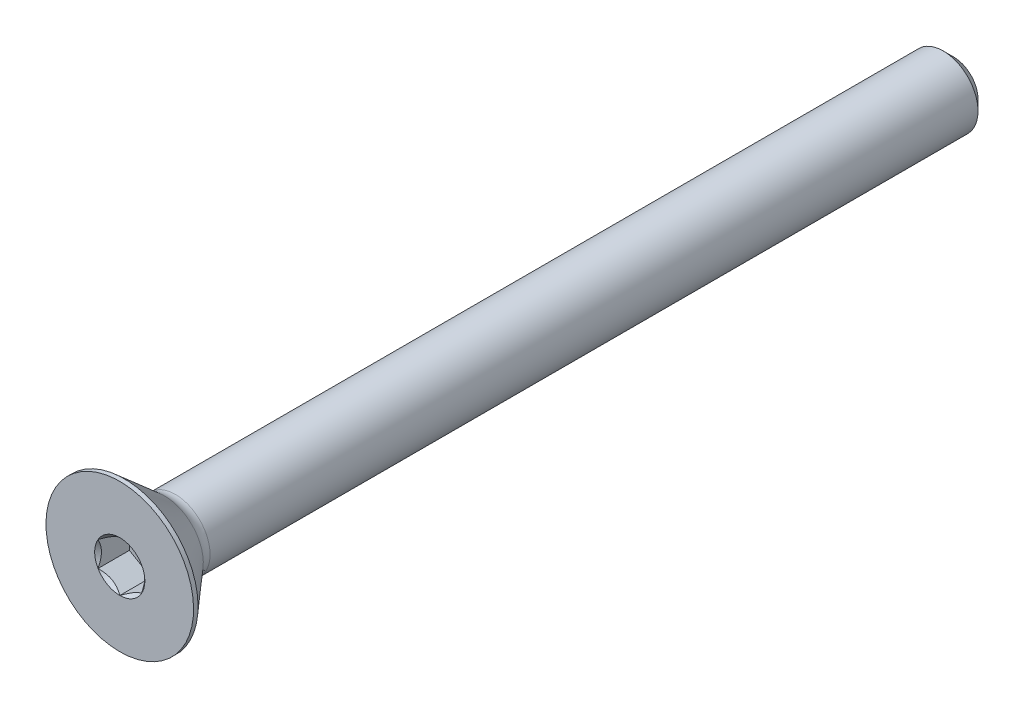
ISO-10303-21;
HEADER;
FILE_DESCRIPTION(('STEP AP214'),'2;1');
FILE_NAME('part.step','',(''),(''),'','','');
FILE_SCHEMA(('AUTOMOTIVE_DESIGN { 1 0 10303 214 1 1 1 1 }'));
ENDSEC;
DATA;
#1=APPLICATION_CONTEXT('core data for automotive mechanical design processes');
#2=APPLICATION_PROTOCOL_DEFINITION('international standard','automotive_design',2000,#1);
#3=PRODUCT_CONTEXT('',#1,'mechanical');
#4=PRODUCT('Part','Part','',(#3));
#5=PRODUCT_RELATED_PRODUCT_CATEGORY('part','',(#4));
#6=PRODUCT_DEFINITION_FORMATION('','',#4);
#7=PRODUCT_DEFINITION_CONTEXT('part definition',#1,'design');
#8=PRODUCT_DEFINITION('design','',#6,#7);
#9=PRODUCT_DEFINITION_SHAPE('','',#8);
#10=(LENGTH_UNIT() NAMED_UNIT(*) SI_UNIT(.MILLI.,.METRE.));
#11=(NAMED_UNIT(*) PLANE_ANGLE_UNIT() SI_UNIT($,.RADIAN.));
#12=(NAMED_UNIT(*) SI_UNIT($,.STERADIAN.) SOLID_ANGLE_UNIT());
#13=UNCERTAINTY_MEASURE_WITH_UNIT(LENGTH_MEASURE(1.E-05),#10,'distance_accuracy_value','');
#14=(GEOMETRIC_REPRESENTATION_CONTEXT(3) GLOBAL_UNCERTAINTY_ASSIGNED_CONTEXT((#13)) GLOBAL_UNIT_ASSIGNED_CONTEXT((#10,
#11,#12)) REPRESENTATION_CONTEXT('',''));
#15=CARTESIAN_POINT('',(0.,0.,0.));
#16=DIRECTION('',(0.,0.,1.));
#17=DIRECTION('',(1.,0.,0.));
#18=AXIS2_PLACEMENT_3D('',#15,#16,#17);
#19=CARTESIAN_POINT('',(0.,0.,-76.2));
#20=DIRECTION('',(0.,0.,-1.));
#21=DIRECTION('',(0.,1.,0.));
#22=AXIS2_PLACEMENT_3D('',#19,#20,#21);
#23=CYLINDRICAL_SURFACE('',#22,3.175);
#24=CARTESIAN_POINT('',(0.,0.,-75.2475));
#25=DIRECTION('',(0.,0.,-1.));
#26=DIRECTION('',(0.,1.,0.));
#27=AXIS2_PLACEMENT_3D('',#24,#25,#26);
#28=CIRCLE('',#27,3.175);
#29=CARTESIAN_POINT('',(0.,3.175,-75.2475));
#30=VERTEX_POINT('',#29);
#31=EDGE_CURVE('E50',#30,#30,#28,.F.);
#32=ORIENTED_EDGE('',*,*,#31,.T.);
#33=EDGE_LOOP('',(#32));
#34=FACE_BOUND('',#33,.T.);
#35=CARTESIAN_POINT('',(0.,0.,-5.07720440387604));
#36=DIRECTION('',(0.,0.,1.));
#37=DIRECTION('',(0.,-1.,0.));
#38=AXIS2_PLACEMENT_3D('',#35,#36,#37);
#39=CIRCLE('',#38,3.175);
#40=CARTESIAN_POINT('',(0.,-3.17500000000001,-5.07720440387604));
#41=VERTEX_POINT('',#40);
#42=EDGE_CURVE('E177',#41,#41,#39,.T.);
#43=ORIENTED_EDGE('',*,*,#42,.F.);
#44=EDGE_LOOP('',(#43));
#45=FACE_BOUND('',#44,.T.);
#46=ADVANCED_FACE('F36',(#34,#45),#23,.T.);
#47=CARTESIAN_POINT('',(0.,-3.17499999999999,-76.2));
#48=DIRECTION('',(0.,0.,-1.));
#49=DIRECTION('',(0.,1.,0.));
#50=AXIS2_PLACEMENT_3D('',#47,#48,#49);
#51=PLANE('',#50);
#52=CARTESIAN_POINT('',(0.,0.,-76.2));
#53=DIRECTION('',(0.,0.,-1.));
#54=DIRECTION('',(0.,1.,0.));
#55=AXIS2_PLACEMENT_3D('',#52,#53,#54);
#56=CIRCLE('',#55,2.2225);
#57=CARTESIAN_POINT('',(0.,2.22250000000001,-76.2));
#58=VERTEX_POINT('',#57);
#59=EDGE_CURVE('E180',#58,#58,#56,.T.);
#60=ORIENTED_EDGE('',*,*,#59,.T.);
#61=EDGE_LOOP('',(#60));
#62=FACE_BOUND('',#61,.T.);
#63=ADVANCED_FACE('F190',(#62),#51,.T.);
#64=CARTESIAN_POINT('',(0.,0.,-76.2));
#65=DIRECTION('',(0.,0.,1.));
#66=DIRECTION('',(0.,-1.,0.));
#67=AXIS2_PLACEMENT_3D('',#64,#65,#66);
#68=CONICAL_SURFACE('',#67,2.2225,0.785398163397442);
#69=ORIENTED_EDGE('',*,*,#31,.F.);
#70=EDGE_LOOP('',(#69));
#71=FACE_BOUND('',#70,.T.);
#72=ORIENTED_EDGE('',*,*,#59,.F.);
#73=EDGE_LOOP('',(#72));
#74=FACE_BOUND('',#73,.T.);
#75=ADVANCED_FACE('F38',(#71,#74),#68,.T.);
#76=CARTESIAN_POINT('',(0.,0.,-5.07720440387604));
#77=DIRECTION('',(0.,0.,1.));
#78=DIRECTION('',(0.,-1.,0.));
#79=AXIS2_PLACEMENT_3D('',#76,#77,#78);
#80=TOROIDAL_SURFACE('',#79,4.68066391166966,1.50566391166966);
#81=CARTESIAN_POINT('',(0.,0.,-4.0894));
#82=DIRECTION('',(0.,0.,1.));
#83=DIRECTION('',(0.,-1.,0.));
#84=AXIS2_PLACEMENT_3D('',#81,#82,#83);
#85=CIRCLE('',#84,3.54432493293688);
#86=CARTESIAN_POINT('',(0.,-3.54432493293688,-4.0894));
#87=VERTEX_POINT('',#86);
#88=EDGE_CURVE('E174',#87,#87,#85,.T.);
#89=ORIENTED_EDGE('',*,*,#88,.F.);
#90=EDGE_LOOP('',(#89));
#91=FACE_BOUND('',#90,.T.);
#92=ORIENTED_EDGE('',*,*,#42,.T.);
#93=EDGE_LOOP('',(#92));
#94=FACE_BOUND('',#93,.T.);
#95=ADVANCED_FACE('F189',(#91,#94),#80,.F.);
#96=CARTESIAN_POINT('',(0.,0.,-4.0894));
#97=DIRECTION('',(0.,0.,1.));
#98=DIRECTION('',(0.,-1.,0.));
#99=AXIS2_PLACEMENT_3D('',#96,#97,#98);
#100=CONICAL_SURFACE('',#99,3.54432493293688,0.715584993317676);
#101=CARTESIAN_POINT('',(0.,0.,-0.408939999999995));
#102=DIRECTION('',(0.,0.,1.));
#103=DIRECTION('',(0.,-1.,0.));
#104=AXIS2_PLACEMENT_3D('',#101,#102,#103);
#105=CIRCLE('',#104,6.7437);
#106=CARTESIAN_POINT('',(0.,-6.7437,-0.40893999999999));
#107=VERTEX_POINT('',#106);
#108=EDGE_CURVE('E171',#107,#107,#105,.T.);
#109=ORIENTED_EDGE('',*,*,#108,.F.);
#110=EDGE_LOOP('',(#109));
#111=FACE_BOUND('',#110,.T.);
#112=ORIENTED_EDGE('',*,*,#88,.T.);
#113=EDGE_LOOP('',(#112));
#114=FACE_BOUND('',#113,.T.);
#115=ADVANCED_FACE('F204',(#111,#114),#100,.T.);
#116=CARTESIAN_POINT('',(0.,0.,0.));
#117=DIRECTION('',(0.,0.,1.));
#118=DIRECTION('',(0.,-1.,0.));
#119=AXIS2_PLACEMENT_3D('',#116,#117,#118);
#120=CYLINDRICAL_SURFACE('',#119,6.7437);
#121=CARTESIAN_POINT('',(0.,0.,0.));
#122=DIRECTION('',(0.,0.,1.));
#123=DIRECTION('',(0.,-1.,0.));
#124=AXIS2_PLACEMENT_3D('',#121,#122,#123);
#125=CIRCLE('',#124,6.7437);
#126=CARTESIAN_POINT('',(0.,-6.7437,0.));
#127=VERTEX_POINT('',#126);
#128=EDGE_CURVE('E168',#127,#127,#125,.T.);
#129=ORIENTED_EDGE('',*,*,#128,.F.);
#130=EDGE_LOOP('',(#129));
#131=FACE_BOUND('',#130,.T.);
#132=ORIENTED_EDGE('',*,*,#108,.T.);
#133=EDGE_LOOP('',(#132));
#134=FACE_BOUND('',#133,.T.);
#135=ADVANCED_FACE('F200',(#131,#134),#120,.T.);
#136=CARTESIAN_POINT('',(0.,-3.175,0.));
#137=DIRECTION('',(0.,0.,1.));
#138=DIRECTION('',(0.,-1.,0.));
#139=AXIS2_PLACEMENT_3D('',#136,#137,#138);
#140=PLANE('',#139);
#141=CARTESIAN_POINT('',(0.,0.,0.));
#142=DIRECTION('',(0.,0.,1.));
#143=DIRECTION('',(1.,0.,0.));
#144=AXIS2_PLACEMENT_3D('',#141,#142,#143);
#145=CIRCLE('',#144,2.29135888084633);
#146=CARTESIAN_POINT('',(0.,-2.29135888084633,0.));
#147=VERTEX_POINT('',#146);
#148=CARTESIAN_POINT('',(1.984375,-1.14567944042317,0.));
#149=VERTEX_POINT('',#148);
#150=EDGE_CURVE('E96',#147,#149,#145,.T.);
#151=ORIENTED_EDGE('',*,*,#150,.F.);
#152=CARTESIAN_POINT('',(-1.984375,-1.14567944042316,0.));
#153=VERTEX_POINT('',#152);
#154=EDGE_CURVE('E56',#153,#147,#145,.T.);
#155=ORIENTED_EDGE('',*,*,#154,.F.);
#156=CARTESIAN_POINT('',(-1.984375,1.14567944042317,0.));
#157=VERTEX_POINT('',#156);
#158=EDGE_CURVE('E138',#157,#153,#145,.T.);
#159=ORIENTED_EDGE('',*,*,#158,.F.);
#160=CARTESIAN_POINT('',(0.,2.29135888084633,0.));
#161=VERTEX_POINT('',#160);
#162=EDGE_CURVE('E63',#161,#157,#145,.T.);
#163=ORIENTED_EDGE('',*,*,#162,.F.);
#164=CARTESIAN_POINT('',(1.984375,1.14567944042317,0.));
#165=VERTEX_POINT('',#164);
#166=EDGE_CURVE('E132',#165,#161,#145,.T.);
#167=ORIENTED_EDGE('',*,*,#166,.F.);
#168=EDGE_CURVE('E104',#149,#165,#145,.T.);
#169=ORIENTED_EDGE('',*,*,#168,.F.);
#170=EDGE_LOOP('',(#151,#155,#159,#163,#167,#169));
#171=FACE_BOUND('',#170,.T.);
#172=ORIENTED_EDGE('',*,*,#128,.T.);
#173=EDGE_LOOP('',(#172));
#174=FACE_BOUND('',#173,.T.);
#175=ADVANCED_FACE('F130',(#171,#174),#140,.T.);
#176=CARTESIAN_POINT('',(0.,0.,0.));
#177=DIRECTION('',(0.,0.,1.));
#178=DIRECTION('',(1.,0.,0.));
#179=AXIS2_PLACEMENT_3D('',#176,#177,#178);
#180=CONICAL_SURFACE('',#179,2.29135888084633,0.78539816339745);
#181=ORIENTED_EDGE('',*,*,#168,.T.);
#182=CARTESIAN_POINT('',(1.984375,-2.28495242157823,0.734984078816569));
#183=CARTESIAN_POINT('',(1.984375,-2.22931635455402,0.692986685550763));
#184=CARTESIAN_POINT('',(1.984375,-2.17336876548389,0.651396054076337));
#185=CARTESIAN_POINT('',(1.984375,-2.06072770258171,0.56920846147148));
#186=CARTESIAN_POINT('',(1.984375,-2.00403404503435,0.528611752405044));
#187=CARTESIAN_POINT('',(1.984375,-1.88936329173489,0.448303503174669));
#188=CARTESIAN_POINT('',(1.984375,-1.83137965519348,0.408601258813308));
#189=CARTESIAN_POINT('',(1.984375,-1.7144280213784,0.330685173401292));
#190=CARTESIAN_POINT('',(1.984375,-1.65546009407228,0.292471227194369));
#191=CARTESIAN_POINT('',(1.984375,-1.47005472306035,0.176252834013637));
#192=CARTESIAN_POINT('',(1.984375,-1.34163909427884,0.101347886872381));
#193=CARTESIAN_POINT('',(1.984375,-1.0784038470548,-0.0356697845602627));
#194=CARTESIAN_POINT('',(1.984375,-0.943607781407426,-0.0978256335176253));
#195=CARTESIAN_POINT('',(1.984375,-0.741275100444883,-0.173867421311382));
#196=CARTESIAN_POINT('',(1.984375,-0.676735408881096,-0.195691938673996));
#197=CARTESIAN_POINT('',(1.984375,-0.546098118112763,-0.234159536462206));
#198=CARTESIAN_POINT('',(1.984375,-0.480000411919957,-0.250802259934452));
#199=CARTESIAN_POINT('',(1.984375,-0.347746170028533,-0.277764619130278));
#200=CARTESIAN_POINT('',(1.984375,-0.281612071479124,-0.288192590264109));
#201=CARTESIAN_POINT('',(1.984375,-0.148636620052351,-0.302521852623405));
#202=CARTESIAN_POINT('',(1.984375,-0.0817953907393245,-0.306424265772615));
#203=CARTESIAN_POINT('',(1.984375,0.0495156750890637,-0.307412948667328));
#204=CARTESIAN_POINT('',(1.984375,0.113983775102991,-0.304740821124986));
#205=CARTESIAN_POINT('',(1.984375,0.242367515846176,-0.293260789502486));
#206=CARTESIAN_POINT('',(1.984375,0.306283102295919,-0.284452289360787));
#207=CARTESIAN_POINT('',(1.984375,0.434181040262184,-0.261030978667104));
#208=CARTESIAN_POINT('',(1.984375,0.498145026858309,-0.246319393767915));
#209=CARTESIAN_POINT('',(1.984375,0.624675616953007,-0.211873818587875));
#210=CARTESIAN_POINT('',(1.984375,0.687242336899688,-0.192140248550806));
#211=CARTESIAN_POINT('',(1.984375,0.884225483826086,-0.122587762769242));
#212=CARTESIAN_POINT('',(1.984375,1.01583674256468,-0.0648475887435049));
#213=CARTESIAN_POINT('',(1.984375,1.27288659242651,0.0635303365887961));
#214=CARTESIAN_POINT('',(1.984375,1.3983008827048,0.13421442491941));
#215=CARTESIAN_POINT('',(1.984375,1.57956687990221,0.244516663813196));
#216=CARTESIAN_POINT('',(1.984375,1.63738271299423,0.280969829475361));
#217=CARTESIAN_POINT('',(1.984375,1.75202215386201,0.355415963291702));
#218=CARTESIAN_POINT('',(1.984375,1.80884568601361,0.393409048078051));
#219=CARTESIAN_POINT('',(1.984375,1.92116923084255,0.470338808893088));
#220=CARTESIAN_POINT('',(1.984375,1.97667624512253,0.509265313038788));
#221=CARTESIAN_POINT('',(1.984375,2.08693170717166,0.588147746121384));
#222=CARTESIAN_POINT('',(1.984375,2.14168035934792,0.628103389024027));
#223=CARTESIAN_POINT('',(1.984375,2.19611149046622,0.668480611285424));
#224=B_SPLINE_CURVE_WITH_KNOTS('',3,(#182,#183,#184,#185,#186,#187,#188,#189,#190,#191,#192,
#193,#194,#195,#196,#197,#198,#199,#200,#201,#202,#203,#204,#205,#206,#207,#208,#209,#210,#211,
#212,#213,#214,#215,#216,#217,#218,#219,#220,#221,#222,#223),.UNSPECIFIED.,.F.,.F.,(4,2,2,2,2,2,
2,2,2,2,2,2,2,2,2,2,2,2,2,2,4),(0.,0.209126070008322,0.41830463735657,0.629103979977993,
0.839888401371186,1.28549951116127,1.72957750768351,1.93379389749972,2.13802435186698,
2.33858179514334,2.53910475350639,2.73236963400794,2.92565329006887,3.12231577097488,
3.31896180041345,3.74886295245172,4.18033428125362,4.3853601718029,4.59040161996383,
4.79377749165108,4.99709743524131),.UNSPECIFIED.);
#225=EDGE_CURVE('E12',#149,#165,#224,.T.);
#226=ORIENTED_EDGE('',*,*,#225,.F.);
#227=EDGE_LOOP('',(#181,#226));
#228=FACE_BOUND('',#227,.T.);
#229=ADVANCED_FACE('F108',(#228),#180,.F.);
#230=ORIENTED_EDGE('',*,*,#166,.T.);
#231=CARTESIAN_POINT('',(1.984575,1.14556397036933,0.000115478781842512));
#232=CARTESIAN_POINT('',(1.9163590048332,1.18494849354192,-0.0392371477360855));
#233=CARTESIAN_POINT('',(1.84700231489303,1.22499159714897,-0.0762786895538155));
#234=CARTESIAN_POINT('',(1.70557619954781,1.30664400291398,-0.144101141576677));
#235=CARTESIAN_POINT('',(1.63349332126322,1.34826107209555,-0.174844310908246));
#236=CARTESIAN_POINT('',(1.488141602734,1.43217992591557,-0.227508111188786));
#237=CARTESIAN_POINT('',(1.41490978751306,1.47446033414663,-0.249561124120036));
#238=CARTESIAN_POINT('',(1.26683381740529,1.55995203534886,-0.283538507056124));
#239=CARTESIAN_POINT('',(1.19199418724658,1.60316071596705,-0.295488243908271));
#240=CARTESIAN_POINT('',(1.06301458545618,1.6776271237807,-0.306269900918094));
#241=CARTESIAN_POINT('',(1.00904128422756,1.7087886237741,-0.30786610094093));
#242=CARTESIAN_POINT('',(0.901182881480199,1.77106070163465,-0.305178161134707));
#243=CARTESIAN_POINT('',(0.847297817514476,1.80217125782056,-0.300891959659541));
#244=CARTESIAN_POINT('',(0.740036461751395,1.86409863044402,-0.286683126986481));
#245=CARTESIAN_POINT('',(0.686660807239859,1.89491507894443,-0.276754189547727));
#246=CARTESIAN_POINT('',(0.580832482591103,1.95601509066828,-0.251804915725461));
#247=CARTESIAN_POINT('',(0.528379742028898,1.9862986945516,-0.236784969610511));
#248=CARTESIAN_POINT('',(0.394017661036351,2.06387267818152,-0.19219214836433));
#249=CARTESIAN_POINT('',(0.312941642841675,2.11068193911104,-0.159257004061667));
#250=CARTESIAN_POINT('',(0.193726693270161,2.17951072233758,-0.103657558797803));
#251=CARTESIAN_POINT('',(0.154440075613999,2.20219286161692,-0.0841224079481374));
#252=CARTESIAN_POINT('',(0.0765946381319475,2.24713694590237,-0.0432712618805983));
#253=CARTESIAN_POINT('',(0.0380353888983018,2.26939913882716,-0.0219563604316494));
#254=CARTESIAN_POINT('',(-0.000199999999999519,2.29147435090017,0.000115478781842769));
#255=B_SPLINE_CURVE_WITH_KNOTS('',3,(#231,#232,#233,#234,#235,#236,#237,#238,#239,#240,#241,
#242,#243,#244,#245,#246,#247,#248,#249,#250,#251,#252,#253,#254),.UNSPECIFIED.,.F.,.F.,(4,2,2,
2,2,2,2,2,2,2,2,4),(0.,0.264339630306627,0.530219665093694,0.79187641637146,1.05287424418109,
1.239639843932,1.42647091743852,1.61351120244035,1.8005371524754,2.09764209964316,
2.24579179873713,2.39385111134157),.UNSPECIFIED.);
#256=EDGE_CURVE('E134',#165,#161,#255,.T.);
#257=ORIENTED_EDGE('',*,*,#256,.F.);
#258=EDGE_LOOP('',(#230,#257));
#259=FACE_BOUND('',#258,.T.);
#260=ADVANCED_FACE('F285',(#259),#180,.F.);
#261=ORIENTED_EDGE('',*,*,#162,.T.);
#262=CARTESIAN_POINT('',(0.000200000000000698,2.29147435090017,0.000115478781843248));
#263=CARTESIAN_POINT('',(-0.0680159951668018,2.25208982772757,-0.0392371477360851));
#264=CARTESIAN_POINT('',(-0.137372685106965,2.21204672412052,-0.0762786895538152));
#265=CARTESIAN_POINT('',(-0.278798800452187,2.13039431835551,-0.144101141576677));
#266=CARTESIAN_POINT('',(-0.350881678736782,2.08877724917394,-0.174844310908247));
#267=CARTESIAN_POINT('',(-0.496233397266004,2.00485839535392,-0.227508111188787));
#268=CARTESIAN_POINT('',(-0.569465212486938,1.96257798712287,-0.249561124120036));
#269=CARTESIAN_POINT('',(-0.717541182594706,1.87708628592063,-0.283538507056124));
#270=CARTESIAN_POINT('',(-0.792380812753425,1.83387760530244,-0.295488243908272));
#271=CARTESIAN_POINT('',(-0.921360414543816,1.75941119748879,-0.306269900918094));
#272=CARTESIAN_POINT('',(-0.975333715772443,1.72824969749539,-0.30786610094093));
#273=CARTESIAN_POINT('',(-1.0831921185198,1.66597761963484,-0.305178161134707));
#274=CARTESIAN_POINT('',(-1.13707718248552,1.63486706344893,-0.30089195965954));
#275=CARTESIAN_POINT('',(-1.2443385382486,1.57293969082547,-0.286683126986481));
#276=CARTESIAN_POINT('',(-1.29771419276014,1.54212324232506,-0.276754189547727));
#277=CARTESIAN_POINT('',(-1.4035425174089,1.48102323060122,-0.251804915725462));
#278=CARTESIAN_POINT('',(-1.4559952579711,1.45073962671789,-0.236784969610512));
#279=CARTESIAN_POINT('',(-1.59035733896365,1.37316564308797,-0.19219214836433));
#280=CARTESIAN_POINT('',(-1.67143335715833,1.32635638215845,-0.159257004061667));
#281=CARTESIAN_POINT('',(-1.79064830672984,1.25752759893191,-0.103657558797803));
#282=CARTESIAN_POINT('',(-1.829934924386,1.23484545965257,-0.0841224079481369));
#283=CARTESIAN_POINT('',(-1.90778036186805,1.18990137536713,-0.0432712618805977));
#284=CARTESIAN_POINT('',(-1.9463396111017,1.16763918244233,-0.0219563604316488));
#285=CARTESIAN_POINT('',(-1.984575,1.14556397036933,0.000115478781843755));
#286=B_SPLINE_CURVE_WITH_KNOTS('',3,(#262,#263,#264,#265,#266,#267,#268,#269,#270,#271,#272,
#273,#274,#275,#276,#277,#278,#279,#280,#281,#282,#283,#284,#285),.UNSPECIFIED.,.F.,.F.,(4,2,2,
2,2,2,2,2,2,2,2,4),(0.,0.264339630306627,0.530219665093694,0.791876416371461,1.05287424418109,
1.239639843932,1.42647091743852,1.61351120244035,1.8005371524754,2.09764209964316,
2.24579179873714,2.39385111134157),.UNSPECIFIED.);
#287=EDGE_CURVE('E137',#161,#157,#286,.T.);
#288=ORIENTED_EDGE('',*,*,#287,.F.);
#289=EDGE_LOOP('',(#261,#288));
#290=FACE_BOUND('',#289,.T.);
#291=ADVANCED_FACE('F281',(#290),#180,.F.);
#292=ORIENTED_EDGE('',*,*,#158,.T.);
#293=CARTESIAN_POINT('',(-1.984375,-2.28495242157822,0.734984078816569));
#294=CARTESIAN_POINT('',(-1.984375,-2.22931635455402,0.692986685550762));
#295=CARTESIAN_POINT('',(-1.984375,-2.17336876548389,0.651396054076337));
#296=CARTESIAN_POINT('',(-1.984375,-2.06072770258171,0.56920846147148));
#297=CARTESIAN_POINT('',(-1.984375,-2.00403404503435,0.528611752405044));
#298=CARTESIAN_POINT('',(-1.984375,-1.88936329173489,0.44830350317467));
#299=CARTESIAN_POINT('',(-1.984375,-1.83137965519348,0.408601258813308));
#300=CARTESIAN_POINT('',(-1.984375,-1.7144280213784,0.330685173401293));
#301=CARTESIAN_POINT('',(-1.984375,-1.65546009407228,0.292471227194369));
#302=CARTESIAN_POINT('',(-1.984375,-1.47005472306035,0.176252834013637));
#303=CARTESIAN_POINT('',(-1.984375,-1.34163909427884,0.101347886872382));
#304=CARTESIAN_POINT('',(-1.984375,-1.0784038470548,-0.0356697845602619));
#305=CARTESIAN_POINT('',(-1.984375,-0.943607781407425,-0.0978256335176249));
#306=CARTESIAN_POINT('',(-1.984375,-0.741275100444882,-0.173867421311381));
#307=CARTESIAN_POINT('',(-1.984375,-0.676735408881095,-0.195691938673995));
#308=CARTESIAN_POINT('',(-1.984375,-0.546098118112761,-0.234159536462205));
#309=CARTESIAN_POINT('',(-1.984375,-0.480000411919955,-0.250802259934451));
#310=CARTESIAN_POINT('',(-1.984375,-0.347746170028531,-0.277764619130277));
#311=CARTESIAN_POINT('',(-1.984375,-0.281612071479122,-0.288192590264108));
#312=CARTESIAN_POINT('',(-1.984375,-0.14863662005235,-0.302521852623404));
#313=CARTESIAN_POINT('',(-1.984375,-0.0817953907393235,-0.306424265772614));
#314=CARTESIAN_POINT('',(-1.984375,0.0495156750890646,-0.307412948667327));
#315=CARTESIAN_POINT('',(-1.984375,0.113983775102992,-0.304740821124985));
#316=CARTESIAN_POINT('',(-1.984375,0.242367515846177,-0.293260789502484));
#317=CARTESIAN_POINT('',(-1.984375,0.30628310229592,-0.284452289360785));
#318=CARTESIAN_POINT('',(-1.984375,0.434181040262184,-0.261030978667103));
#319=CARTESIAN_POINT('',(-1.984375,0.49814502685831,-0.246319393767914));
#320=CARTESIAN_POINT('',(-1.984375,0.624675616953007,-0.211873818587873));
#321=CARTESIAN_POINT('',(-1.984375,0.687242336899689,-0.192140248550804));
#322=CARTESIAN_POINT('',(-1.984375,0.884225483826088,-0.12258776276924));
#323=CARTESIAN_POINT('',(-1.984375,1.01583674256468,-0.0648475887435028));
#324=CARTESIAN_POINT('',(-1.984375,1.27288659242652,0.0635303365887983));
#325=CARTESIAN_POINT('',(-1.984375,1.3983008827048,0.134214424919413));
#326=CARTESIAN_POINT('',(-1.984375,1.57956687990221,0.244516663813198));
#327=CARTESIAN_POINT('',(-1.984375,1.63738271299424,0.280969829475363));
#328=CARTESIAN_POINT('',(-1.984375,1.75202215386202,0.355415963291704));
#329=CARTESIAN_POINT('',(-1.984375,1.80884568601361,0.393409048078054));
#330=CARTESIAN_POINT('',(-1.984375,1.92116923084255,0.47033880889309));
#331=CARTESIAN_POINT('',(-1.984375,1.97667624512253,0.50926531303879));
#332=CARTESIAN_POINT('',(-1.984375,2.08693170717166,0.588147746121385));
#333=CARTESIAN_POINT('',(-1.984375,2.14168035934792,0.628103389024029));
#334=CARTESIAN_POINT('',(-1.984375,2.19611149046622,0.668480611285425));
#335=B_SPLINE_CURVE_WITH_KNOTS('',3,(#293,#294,#295,#296,#297,#298,#299,#300,#301,#302,#303,
#304,#305,#306,#307,#308,#309,#310,#311,#312,#313,#314,#315,#316,#317,#318,#319,#320,#321,#322,
#323,#324,#325,#326,#327,#328,#329,#330,#331,#332,#333,#334),.UNSPECIFIED.,.F.,.F.,(4,2,2,2,2,2,
2,2,2,2,2,2,2,2,2,2,2,2,2,2,4),(0.,0.209126070008322,0.418304637356569,0.629103979977992,
0.839888401371184,1.28549951116127,1.72957750768351,1.93379389749972,2.13802435186698,
2.33858179514334,2.53910475350639,2.73236963400794,2.92565329006887,3.12231577097488,
3.31896180041345,3.74886295245172,4.18033428125362,4.3853601718029,4.59040161996383,
4.79377749165108,4.99709743524131),.UNSPECIFIED.);
#336=EDGE_CURVE('E144',#157,#153,#335,.F.);
#337=ORIENTED_EDGE('',*,*,#336,.F.);
#338=EDGE_LOOP('',(#292,#337));
#339=FACE_BOUND('',#338,.T.);
#340=ADVANCED_FACE('F142',(#339),#180,.F.);
#341=ORIENTED_EDGE('',*,*,#154,.T.);
#342=CARTESIAN_POINT('',(-1.984575,-1.14556397036933,0.000115478781843379));
#343=CARTESIAN_POINT('',(-1.9163590048332,-1.18494849354192,-0.0392371477360854));
#344=CARTESIAN_POINT('',(-1.84700231489303,-1.22499159714897,-0.0762786895538155));
#345=CARTESIAN_POINT('',(-1.70557619954781,-1.30664400291398,-0.144101141576677));
#346=CARTESIAN_POINT('',(-1.63349332126322,-1.34826107209555,-0.174844310908246));
#347=CARTESIAN_POINT('',(-1.488141602734,-1.43217992591557,-0.227508111188786));
#348=CARTESIAN_POINT('',(-1.41490978751306,-1.47446033414663,-0.249561124120036));
#349=CARTESIAN_POINT('',(-1.26683381740529,-1.55995203534886,-0.283538507056124));
#350=CARTESIAN_POINT('',(-1.19199418724658,-1.60316071596705,-0.295488243908272));
#351=CARTESIAN_POINT('',(-1.06301458545618,-1.6776271237807,-0.306269900918094));
#352=CARTESIAN_POINT('',(-1.00904128422756,-1.7087886237741,-0.30786610094093));
#353=CARTESIAN_POINT('',(-0.901182881480199,-1.77106070163465,-0.305178161134708));
#354=CARTESIAN_POINT('',(-0.847297817514476,-1.80217125782056,-0.300891959659541));
#355=CARTESIAN_POINT('',(-0.740036461751396,-1.86409863044402,-0.286683126986481));
#356=CARTESIAN_POINT('',(-0.686660807239859,-1.89491507894443,-0.276754189547727));
#357=CARTESIAN_POINT('',(-0.580832482591103,-1.95601509066828,-0.251804915725461));
#358=CARTESIAN_POINT('',(-0.528379742028898,-1.9862986945516,-0.236784969610511));
#359=CARTESIAN_POINT('',(-0.394017661036351,-2.06387267818152,-0.192192148364329));
#360=CARTESIAN_POINT('',(-0.312941642841675,-2.11068193911104,-0.159257004061667));
#361=CARTESIAN_POINT('',(-0.19372669327016,-2.17951072233758,-0.103657558797803));
#362=CARTESIAN_POINT('',(-0.154440075613999,-2.20219286161692,-0.0841224079481374));
#363=CARTESIAN_POINT('',(-0.076594638131947,-2.24713694590237,-0.043271261880598));
#364=CARTESIAN_POINT('',(-0.0380353888983013,-2.26939913882716,-0.0219563604316491));
#365=CARTESIAN_POINT('',(0.000199999999999913,-2.29147435090017,0.000115478781843129));
#366=B_SPLINE_CURVE_WITH_KNOTS('',3,(#342,#343,#344,#345,#346,#347,#348,#349,#350,#351,#352,
#353,#354,#355,#356,#357,#358,#359,#360,#361,#362,#363,#364,#365),.UNSPECIFIED.,.F.,.F.,(4,2,2,
2,2,2,2,2,2,2,2,4),(0.,0.264339630306627,0.530219665093695,0.791876416371461,1.05287424418109,
1.239639843932,1.42647091743852,1.61351120244035,1.8005371524754,2.09764209964316,
2.24579179873714,2.39385111134157),.UNSPECIFIED.);
#367=EDGE_CURVE('E120',#153,#147,#366,.T.);
#368=ORIENTED_EDGE('',*,*,#367,.F.);
#369=EDGE_LOOP('',(#341,#368));
#370=FACE_BOUND('',#369,.T.);
#371=ADVANCED_FACE('F233',(#370),#180,.F.);
#372=ORIENTED_EDGE('',*,*,#150,.T.);
#373=CARTESIAN_POINT('',(-0.000200000000000155,-2.29147435090017,0.000115478781843248));
#374=CARTESIAN_POINT('',(0.0680159951668022,-2.25208982772757,-0.0392371477360846));
#375=CARTESIAN_POINT('',(0.137372685106966,-2.21204672412052,-0.0762786895538146));
#376=CARTESIAN_POINT('',(0.278798800452187,-2.13039431835551,-0.144101141576676));
#377=CARTESIAN_POINT('',(0.350881678736782,-2.08877724917394,-0.174844310908246));
#378=CARTESIAN_POINT('',(0.496233397266003,-2.00485839535392,-0.227508111188786));
#379=CARTESIAN_POINT('',(0.569465212486938,-1.96257798712287,-0.249561124120036));
#380=CARTESIAN_POINT('',(0.717541182594706,-1.87708628592063,-0.283538507056124));
#381=CARTESIAN_POINT('',(0.792380812753424,-1.83387760530244,-0.295488243908271));
#382=CARTESIAN_POINT('',(0.921360414543815,-1.75941119748879,-0.306269900918094));
#383=CARTESIAN_POINT('',(0.975333715772442,-1.72824969749539,-0.30786610094093));
#384=CARTESIAN_POINT('',(1.0831921185198,-1.66597761963484,-0.305178161134707));
#385=CARTESIAN_POINT('',(1.13707718248552,-1.63486706344893,-0.300891959659541));
#386=CARTESIAN_POINT('',(1.2443385382486,-1.57293969082547,-0.286683126986481));
#387=CARTESIAN_POINT('',(1.29771419276014,-1.54212324232506,-0.276754189547727));
#388=CARTESIAN_POINT('',(1.4035425174089,-1.48102323060122,-0.251804915725461));
#389=CARTESIAN_POINT('',(1.4559952579711,-1.45073962671789,-0.236784969610512));
#390=CARTESIAN_POINT('',(1.59035733896365,-1.37316564308797,-0.19219214836433));
#391=CARTESIAN_POINT('',(1.67143335715832,-1.32635638215845,-0.159257004061668));
#392=CARTESIAN_POINT('',(1.79064830672984,-1.25752759893191,-0.103657558797804));
#393=CARTESIAN_POINT('',(1.829934924386,-1.23484545965257,-0.0841224079481377));
#394=CARTESIAN_POINT('',(1.90778036186805,-1.18990137536713,-0.0432712618805984));
#395=CARTESIAN_POINT('',(1.9463396111017,-1.16763918244233,-0.0219563604316496));
#396=CARTESIAN_POINT('',(1.984575,-1.14556397036933,0.000115478781842675));
#397=B_SPLINE_CURVE_WITH_KNOTS('',3,(#373,#374,#375,#376,#377,#378,#379,#380,#381,#382,#383,
#384,#385,#386,#387,#388,#389,#390,#391,#392,#393,#394,#395,#396),.UNSPECIFIED.,.F.,.F.,(4,2,2,
2,2,2,2,2,2,2,2,4),(0.,0.264339630306626,0.530219665093694,0.79187641637146,1.05287424418109,
1.239639843932,1.42647091743852,1.61351120244035,1.8005371524754,2.09764209964316,
2.24579179873713,2.39385111134157),.UNSPECIFIED.);
#398=EDGE_CURVE('E100',#147,#149,#397,.T.);
#399=ORIENTED_EDGE('',*,*,#398,.F.);
#400=EDGE_LOOP('',(#372,#399));
#401=FACE_BOUND('',#400,.T.);
#402=ADVANCED_FACE('F98',(#401),#180,.F.);
#403=CARTESIAN_POINT('',(1.984375,-1.14567944042317,-2.86258));
#404=DIRECTION('',(0.,0.,1.));
#405=DIRECTION('',(1.,0.,0.));
#406=AXIS2_PLACEMENT_3D('',#403,#404,#405);
#407=PLANE('',#406);
#408=DIRECTION('',(0.866025403784439,0.5,0.));
#409=VECTOR('',#408,1.);
#410=CARTESIAN_POINT('',(0.,-2.29135888084633,-2.86258));
#411=LINE('',#410,#409);
#412=CARTESIAN_POINT('',(0.,-2.29135888084633,-2.86258));
#413=VERTEX_POINT('',#412);
#414=CARTESIAN_POINT('',(1.984375,-1.14567944042317,-2.86258));
#415=VERTEX_POINT('',#414);
#416=EDGE_CURVE('E119',#413,#415,#411,.T.);
#417=ORIENTED_EDGE('',*,*,#416,.T.);
#418=DIRECTION('',(0.,1.,0.));
#419=VECTOR('',#418,1.);
#420=CARTESIAN_POINT('',(1.984375,-1.14567944042317,-2.86258));
#421=LINE('',#420,#419);
#422=CARTESIAN_POINT('',(1.984375,1.14567944042316,-2.86258));
#423=VERTEX_POINT('',#422);
#424=EDGE_CURVE('E124',#415,#423,#421,.T.);
#425=ORIENTED_EDGE('',*,*,#424,.T.);
#426=DIRECTION('',(-0.866025403784439,0.5,0.));
#427=VECTOR('',#426,1.);
#428=CARTESIAN_POINT('',(1.984375,1.14567944042316,-2.86258));
#429=LINE('',#428,#427);
#430=CARTESIAN_POINT('',(0.,2.29135888084633,-2.86258));
#431=VERTEX_POINT('',#430);
#432=EDGE_CURVE('E267',#423,#431,#429,.T.);
#433=ORIENTED_EDGE('',*,*,#432,.T.);
#434=DIRECTION('',(-0.866025403784439,-0.5,0.));
#435=VECTOR('',#434,1.);
#436=CARTESIAN_POINT('',(0.,2.29135888084633,-2.86258));
#437=LINE('',#436,#435);
#438=CARTESIAN_POINT('',(-1.984375,1.14567944042316,-2.86258));
#439=VERTEX_POINT('',#438);
#440=EDGE_CURVE('E269',#431,#439,#437,.T.);
#441=ORIENTED_EDGE('',*,*,#440,.T.);
#442=DIRECTION('',(0.,-1.,0.));
#443=VECTOR('',#442,1.);
#444=CARTESIAN_POINT('',(-1.984375,1.14567944042316,-2.86258));
#445=LINE('',#444,#443);
#446=CARTESIAN_POINT('',(-1.984375,-1.14567944042316,-2.86258));
#447=VERTEX_POINT('',#446);
#448=EDGE_CURVE('E159',#439,#447,#445,.T.);
#449=ORIENTED_EDGE('',*,*,#448,.T.);
#450=DIRECTION('',(0.866025403784438,-0.5,0.));
#451=VECTOR('',#450,1.);
#452=CARTESIAN_POINT('',(-1.984375,-1.14567944042316,-2.86258));
#453=LINE('',#452,#451);
#454=EDGE_CURVE('E127',#447,#413,#453,.T.);
#455=ORIENTED_EDGE('',*,*,#454,.T.);
#456=EDGE_LOOP('',(#417,#425,#433,#441,#449,#455));
#457=FACE_BOUND('',#456,.T.);
#458=ADVANCED_FACE('F232',(#457),#407,.T.);
#459=CARTESIAN_POINT('',(1.984375,-1.14567944042317,-2.86258));
#460=DIRECTION('',(1.,0.,0.));
#461=DIRECTION('',(0.,0.,-1.));
#462=AXIS2_PLACEMENT_3D('',#459,#460,#461);
#463=PLANE('',#462);
#464=DIRECTION('',(0.,0.,1.));
#465=VECTOR('',#464,1.);
#466=CARTESIAN_POINT('',(1.984375,-1.14567944042317,-2.86258));
#467=LINE('',#466,#465);
#468=EDGE_CURVE('E116',#415,#149,#467,.T.);
#469=ORIENTED_EDGE('',*,*,#468,.T.);
#470=ORIENTED_EDGE('',*,*,#225,.T.);
#471=DIRECTION('',(0.,0.,1.));
#472=VECTOR('',#471,1.);
#473=CARTESIAN_POINT('',(1.984375,1.14567944042316,-2.86258));
#474=LINE('',#473,#472);
#475=EDGE_CURVE('E126',#423,#165,#474,.T.);
#476=ORIENTED_EDGE('',*,*,#475,.F.);
#477=ORIENTED_EDGE('',*,*,#424,.F.);
#478=EDGE_LOOP('',(#469,#470,#476,#477));
#479=FACE_BOUND('',#478,.T.);
#480=ADVANCED_FACE('F122',(#479),#463,.F.);
#481=CARTESIAN_POINT('',(1.984375,1.14567944042316,-2.86258));
#482=DIRECTION('',(0.5,0.866025403784439,0.));
#483=DIRECTION('',(-0.866025403784439,0.5,0.));
#484=AXIS2_PLACEMENT_3D('',#481,#482,#483);
#485=PLANE('',#484);
#486=ORIENTED_EDGE('',*,*,#475,.T.);
#487=ORIENTED_EDGE('',*,*,#256,.T.);
#488=DIRECTION('',(0.,0.,1.));
#489=VECTOR('',#488,1.);
#490=CARTESIAN_POINT('',(0.,2.29135888084633,-2.86258));
#491=LINE('',#490,#489);
#492=EDGE_CURVE('E155',#431,#161,#491,.T.);
#493=ORIENTED_EDGE('',*,*,#492,.F.);
#494=ORIENTED_EDGE('',*,*,#432,.F.);
#495=EDGE_LOOP('',(#486,#487,#493,#494));
#496=FACE_BOUND('',#495,.T.);
#497=ADVANCED_FACE('F258',(#496),#485,.F.);
#498=CARTESIAN_POINT('',(0.,2.29135888084633,-2.86258));
#499=DIRECTION('',(-0.5,0.866025403784439,0.));
#500=DIRECTION('',(-0.866025403784439,-0.5,0.));
#501=AXIS2_PLACEMENT_3D('',#498,#499,#500);
#502=PLANE('',#501);
#503=ORIENTED_EDGE('',*,*,#492,.T.);
#504=ORIENTED_EDGE('',*,*,#287,.T.);
#505=DIRECTION('',(0.,0.,1.));
#506=VECTOR('',#505,1.);
#507=CARTESIAN_POINT('',(-1.984375,1.14567944042316,-2.86258));
#508=LINE('',#507,#506);
#509=EDGE_CURVE('E153',#439,#157,#508,.T.);
#510=ORIENTED_EDGE('',*,*,#509,.F.);
#511=ORIENTED_EDGE('',*,*,#440,.F.);
#512=EDGE_LOOP('',(#503,#504,#510,#511));
#513=FACE_BOUND('',#512,.T.);
#514=ADVANCED_FACE('F151',(#513),#502,.F.);
#515=CARTESIAN_POINT('',(-1.984375,1.14567944042316,-2.86258));
#516=DIRECTION('',(-1.,0.,0.));
#517=DIRECTION('',(0.,0.,1.));
#518=AXIS2_PLACEMENT_3D('',#515,#516,#517);
#519=PLANE('',#518);
#520=ORIENTED_EDGE('',*,*,#509,.T.);
#521=ORIENTED_EDGE('',*,*,#336,.T.);
#522=DIRECTION('',(0.,0.,1.));
#523=VECTOR('',#522,1.);
#524=CARTESIAN_POINT('',(-1.984375,-1.14567944042316,-2.86258));
#525=LINE('',#524,#523);
#526=EDGE_CURVE('E161',#447,#153,#525,.T.);
#527=ORIENTED_EDGE('',*,*,#526,.F.);
#528=ORIENTED_EDGE('',*,*,#448,.F.);
#529=EDGE_LOOP('',(#520,#521,#527,#528));
#530=FACE_BOUND('',#529,.T.);
#531=ADVANCED_FACE('F157',(#530),#519,.F.);
#532=CARTESIAN_POINT('',(-1.984375,-1.14567944042316,-2.86258));
#533=DIRECTION('',(-0.5,-0.866025403784439,0.));
#534=DIRECTION('',(0.866025403784439,-0.5,0.));
#535=AXIS2_PLACEMENT_3D('',#532,#533,#534);
#536=PLANE('',#535);
#537=ORIENTED_EDGE('',*,*,#526,.T.);
#538=ORIENTED_EDGE('',*,*,#367,.T.);
#539=DIRECTION('',(0.,0.,1.));
#540=VECTOR('',#539,1.);
#541=CARTESIAN_POINT('',(0.,-2.29135888084633,-2.86258));
#542=LINE('',#541,#540);
#543=EDGE_CURVE('E118',#413,#147,#542,.T.);
#544=ORIENTED_EDGE('',*,*,#543,.F.);
#545=ORIENTED_EDGE('',*,*,#454,.F.);
#546=EDGE_LOOP('',(#537,#538,#544,#545));
#547=FACE_BOUND('',#546,.T.);
#548=ADVANCED_FACE('F214',(#547),#536,.F.);
#549=CARTESIAN_POINT('',(0.,-2.29135888084633,-2.86258));
#550=DIRECTION('',(0.5,-0.866025403784439,0.));
#551=DIRECTION('',(0.866025403784439,0.5,0.));
#552=AXIS2_PLACEMENT_3D('',#549,#550,#551);
#553=PLANE('',#552);
#554=ORIENTED_EDGE('',*,*,#543,.T.);
#555=ORIENTED_EDGE('',*,*,#398,.T.);
#556=ORIENTED_EDGE('',*,*,#468,.F.);
#557=ORIENTED_EDGE('',*,*,#416,.F.);
#558=EDGE_LOOP('',(#554,#555,#556,#557));
#559=FACE_BOUND('',#558,.T.);
#560=ADVANCED_FACE('F114',(#559),#553,.F.);
#561=CLOSED_SHELL('',(#46,#63,#75,#95,#115,#135,#175,#229,#260,#291,#340,#371,#402,#458,#480,
#497,#514,#531,#548,#560));
#562=MANIFOLD_SOLID_BREP('B2',#561);
#563=ADVANCED_BREP_SHAPE_REPRESENTATION('',(#18,#562),#14);
#564=SHAPE_DEFINITION_REPRESENTATION(#9,#563);
ENDSEC;
END-ISO-10303-21;
